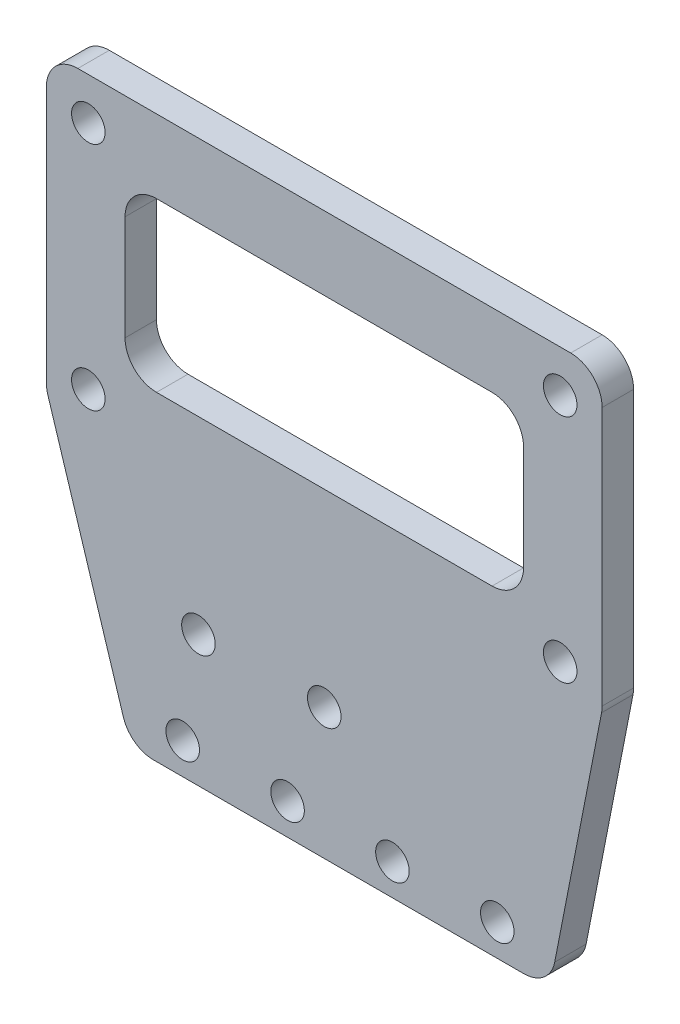
ISO-10303-21;
HEADER;
FILE_DESCRIPTION(('STEP AP214'),'2;1');
FILE_NAME('part.step','',(''),(''),'','','');
FILE_SCHEMA(('AUTOMOTIVE_DESIGN { 1 0 10303 214 1 1 1 1 }'));
ENDSEC;
DATA;
#1=APPLICATION_CONTEXT('core data for automotive mechanical design processes');
#2=APPLICATION_PROTOCOL_DEFINITION('international standard','automotive_design',2000,#1);
#3=PRODUCT_CONTEXT('',#1,'mechanical');
#4=PRODUCT('Part','Part','',(#3));
#5=PRODUCT_RELATED_PRODUCT_CATEGORY('part','',(#4));
#6=PRODUCT_DEFINITION_FORMATION('','',#4);
#7=PRODUCT_DEFINITION_CONTEXT('part definition',#1,'design');
#8=PRODUCT_DEFINITION('design','',#6,#7);
#9=PRODUCT_DEFINITION_SHAPE('','',#8);
#10=(LENGTH_UNIT() NAMED_UNIT(*) SI_UNIT(.MILLI.,.METRE.));
#11=(NAMED_UNIT(*) PLANE_ANGLE_UNIT() SI_UNIT($,.RADIAN.));
#12=(NAMED_UNIT(*) SI_UNIT($,.STERADIAN.) SOLID_ANGLE_UNIT());
#13=UNCERTAINTY_MEASURE_WITH_UNIT(LENGTH_MEASURE(1.E-05),#10,'distance_accuracy_value','');
#14=(GEOMETRIC_REPRESENTATION_CONTEXT(3) GLOBAL_UNCERTAINTY_ASSIGNED_CONTEXT((#13)) GLOBAL_UNIT_ASSIGNED_CONTEXT((#10,
#11,#12)) REPRESENTATION_CONTEXT('',''));
#15=CARTESIAN_POINT('',(0.,0.,0.));
#16=DIRECTION('',(0.,0.,1.));
#17=DIRECTION('',(1.,0.,0.));
#18=AXIS2_PLACEMENT_3D('',#15,#16,#17);
#19=CARTESIAN_POINT('',(0.,0.,3.));
#20=DIRECTION('',(0.,0.,-1.));
#21=DIRECTION('',(-1.,0.,0.));
#22=AXIS2_PLACEMENT_3D('',#19,#20,#21);
#23=PLANE('',#22);
#24=DIRECTION('',(0.,-1.,0.));
#25=VECTOR('',#24,1.);
#26=CARTESIAN_POINT('',(-2.5,46.5,3.));
#27=LINE('',#26,#25);
#28=CARTESIAN_POINT('',(-2.5,43.5,3.));
#29=VERTEX_POINT('',#28);
#30=CARTESIAN_POINT('',(-2.5,33.5,3.));
#31=VERTEX_POINT('',#30);
#32=EDGE_CURVE('E315',#29,#31,#27,.T.);
#33=ORIENTED_EDGE('',*,*,#32,.T.);
#34=CARTESIAN_POINT('',(-5.5,33.5,3.));
#35=DIRECTION('',(0.,0.,-1.));
#36=DIRECTION('',(-1.,0.,0.));
#37=AXIS2_PLACEMENT_3D('',#34,#35,#36);
#38=CIRCLE('',#37,3.);
#39=CARTESIAN_POINT('',(-5.5,30.5,3.));
#40=VERTEX_POINT('',#39);
#41=EDGE_CURVE('E11',#31,#40,#38,.T.);
#42=ORIENTED_EDGE('',*,*,#41,.T.);
#43=DIRECTION('',(-1.,0.,0.));
#44=VECTOR('',#43,1.);
#45=CARTESIAN_POINT('',(-2.5,30.5,3.));
#46=LINE('',#45,#44);
#47=CARTESIAN_POINT('',(-37.5,30.5,3.));
#48=VERTEX_POINT('',#47);
#49=EDGE_CURVE('E313',#40,#48,#46,.T.);
#50=ORIENTED_EDGE('',*,*,#49,.T.);
#51=CARTESIAN_POINT('',(-37.5,33.5,3.));
#52=DIRECTION('',(0.,0.,-1.));
#53=DIRECTION('',(-1.,0.,0.));
#54=AXIS2_PLACEMENT_3D('',#51,#52,#53);
#55=CIRCLE('',#54,3.);
#56=CARTESIAN_POINT('',(-40.5,33.5,3.));
#57=VERTEX_POINT('',#56);
#58=EDGE_CURVE('E287',#48,#57,#55,.T.);
#59=ORIENTED_EDGE('',*,*,#58,.T.);
#60=DIRECTION('',(0.,1.,0.));
#61=VECTOR('',#60,1.);
#62=CARTESIAN_POINT('',(-40.5,46.5,3.));
#63=LINE('',#62,#61);
#64=CARTESIAN_POINT('',(-40.5,43.5,3.));
#65=VERTEX_POINT('',#64);
#66=EDGE_CURVE('E334',#57,#65,#63,.T.);
#67=ORIENTED_EDGE('',*,*,#66,.T.);
#68=CARTESIAN_POINT('',(-37.5,43.5,3.));
#69=DIRECTION('',(0.,0.,-1.));
#70=DIRECTION('',(-1.,0.,0.));
#71=AXIS2_PLACEMENT_3D('',#68,#69,#70);
#72=CIRCLE('',#71,3.);
#73=CARTESIAN_POINT('',(-37.5,46.5,3.));
#74=VERTEX_POINT('',#73);
#75=EDGE_CURVE('E291',#65,#74,#72,.T.);
#76=ORIENTED_EDGE('',*,*,#75,.T.);
#77=DIRECTION('',(1.,0.,0.));
#78=VECTOR('',#77,1.);
#79=CARTESIAN_POINT('',(-2.5,46.5,3.));
#80=LINE('',#79,#78);
#81=CARTESIAN_POINT('',(-5.5,46.5,3.));
#82=VERTEX_POINT('',#81);
#83=EDGE_CURVE('E324',#74,#82,#80,.T.);
#84=ORIENTED_EDGE('',*,*,#83,.T.);
#85=CARTESIAN_POINT('',(-5.5,43.5,3.));
#86=DIRECTION('',(0.,0.,-1.));
#87=DIRECTION('',(-1.,0.,0.));
#88=AXIS2_PLACEMENT_3D('',#85,#86,#87);
#89=CIRCLE('',#88,3.);
#90=EDGE_CURVE('E56',#82,#29,#89,.T.);
#91=ORIENTED_EDGE('',*,*,#90,.T.);
#92=EDGE_LOOP('',(#33,#42,#50,#59,#67,#76,#84,#91));
#93=FACE_BOUND('',#92,.T.);
#94=CARTESIAN_POINT('',(-33.5,12.5,3.));
#95=DIRECTION('',(0.,0.,1.));
#96=DIRECTION('',(1.,0.,0.));
#97=AXIS2_PLACEMENT_3D('',#94,#95,#96);
#98=CIRCLE('',#97,1.60000000000001);
#99=CARTESIAN_POINT('',(-31.9,12.5,3.));
#100=VERTEX_POINT('',#99);
#101=EDGE_CURVE('E339',#100,#100,#98,.T.);
#102=ORIENTED_EDGE('',*,*,#101,.F.);
#103=EDGE_LOOP('',(#102));
#104=FACE_BOUND('',#103,.T.);
#105=CARTESIAN_POINT('',(-21.5,12.5,3.));
#106=DIRECTION('',(0.,0.,1.));
#107=DIRECTION('',(1.,0.,0.));
#108=AXIS2_PLACEMENT_3D('',#105,#106,#107);
#109=CIRCLE('',#108,1.60000000000001);
#110=CARTESIAN_POINT('',(-19.9,12.5,3.));
#111=VERTEX_POINT('',#110);
#112=EDGE_CURVE('E319',#111,#111,#109,.T.);
#113=ORIENTED_EDGE('',*,*,#112,.F.);
#114=EDGE_LOOP('',(#113));
#115=FACE_BOUND('',#114,.T.);
#116=CARTESIAN_POINT('',(-5.,3.,3.));
#117=DIRECTION('',(0.,0.,1.));
#118=DIRECTION('',(1.,0.,0.));
#119=AXIS2_PLACEMENT_3D('',#116,#117,#118);
#120=CIRCLE('',#119,1.6);
#121=CARTESIAN_POINT('',(-3.4,3.,3.));
#122=VERTEX_POINT('',#121);
#123=EDGE_CURVE('E348',#122,#122,#120,.T.);
#124=ORIENTED_EDGE('',*,*,#123,.F.);
#125=EDGE_LOOP('',(#124));
#126=FACE_BOUND('',#125,.T.);
#127=CARTESIAN_POINT('',(-15.,2.99999999999993,3.));
#128=DIRECTION('',(0.,0.,1.));
#129=DIRECTION('',(1.,0.,0.));
#130=AXIS2_PLACEMENT_3D('',#127,#128,#129);
#131=CIRCLE('',#130,1.6);
#132=CARTESIAN_POINT('',(-13.4,2.99999999999993,3.));
#133=VERTEX_POINT('',#132);
#134=EDGE_CURVE('E354',#133,#133,#131,.T.);
#135=ORIENTED_EDGE('',*,*,#134,.F.);
#136=EDGE_LOOP('',(#135));
#137=FACE_BOUND('',#136,.T.);
#138=CARTESIAN_POINT('',(-25.,2.99999999999986,3.));
#139=DIRECTION('',(0.,0.,1.));
#140=DIRECTION('',(1.,0.,0.));
#141=AXIS2_PLACEMENT_3D('',#138,#139,#140);
#142=CIRCLE('',#141,1.6);
#143=CARTESIAN_POINT('',(-23.4,2.99999999999986,3.));
#144=VERTEX_POINT('',#143);
#145=EDGE_CURVE('E360',#144,#144,#142,.T.);
#146=ORIENTED_EDGE('',*,*,#145,.F.);
#147=EDGE_LOOP('',(#146));
#148=FACE_BOUND('',#147,.T.);
#149=CARTESIAN_POINT('',(-35.,2.99999999999979,3.));
#150=DIRECTION('',(0.,0.,1.));
#151=DIRECTION('',(1.,0.,0.));
#152=AXIS2_PLACEMENT_3D('',#149,#150,#151);
#153=CIRCLE('',#152,1.6);
#154=CARTESIAN_POINT('',(-33.4,2.99999999999979,3.));
#155=VERTEX_POINT('',#154);
#156=EDGE_CURVE('E338',#155,#155,#153,.T.);
#157=ORIENTED_EDGE('',*,*,#156,.F.);
#158=EDGE_LOOP('',(#157));
#159=FACE_BOUND('',#158,.T.);
#160=DIRECTION('',(1.,0.,0.));
#161=VECTOR('',#160,1.);
#162=CARTESIAN_POINT('',(0.,0.,3.));
#163=LINE('',#162,#161);
#164=CARTESIAN_POINT('',(-37.7958574255979,0.,3.));
#165=VERTEX_POINT('',#164);
#166=CARTESIAN_POINT('',(-2.46971763062084,0.,3.));
#167=VERTEX_POINT('',#166);
#168=EDGE_CURVE('E209',#165,#167,#163,.T.);
#169=ORIENTED_EDGE('',*,*,#168,.T.);
#170=CARTESIAN_POINT('',(-2.46971763062085,3.,3.));
#171=DIRECTION('',(0.,0.,-1.));
#172=DIRECTION('',(-1.,0.,0.));
#173=AXIS2_PLACEMENT_3D('',#170,#171,#172);
#174=CIRCLE('',#173,3.);
#175=CARTESIAN_POINT('',(0.474413109820908,2.42372386550726,3.));
#176=VERTEX_POINT('',#175);
#177=EDGE_CURVE('E244',#167,#176,#174,.F.);
#178=ORIENTED_EDGE('',*,*,#177,.T.);
#179=DIRECTION('',(0.192092044830911,0.981376913480585,0.));
#180=VECTOR('',#179,1.);
#181=CARTESIAN_POINT('',(5.,25.5444444444444,3.));
#182=LINE('',#181,#180);
#183=CARTESIAN_POINT('',(4.94413074044176,25.2590146050569,3.));
#184=VERTEX_POINT('',#183);
#185=EDGE_CURVE('E192',#176,#184,#182,.T.);
#186=ORIENTED_EDGE('',*,*,#185,.T.);
#187=CARTESIAN_POINT('',(2.,25.8352907395496,3.));
#188=DIRECTION('',(0.,0.,-1.));
#189=DIRECTION('',(-1.,0.,0.));
#190=AXIS2_PLACEMENT_3D('',#187,#188,#189);
#191=CIRCLE('',#190,3.);
#192=CARTESIAN_POINT('',(5.,25.8352907395496,3.));
#193=VERTEX_POINT('',#192);
#194=EDGE_CURVE('E242',#184,#193,#191,.F.);
#195=ORIENTED_EDGE('',*,*,#194,.T.);
#196=DIRECTION('',(0.,1.,0.));
#197=VECTOR('',#196,1.);
#198=CARTESIAN_POINT('',(5.,53.5,3.));
#199=LINE('',#198,#197);
#200=CARTESIAN_POINT('',(5.,50.5,3.));
#201=VERTEX_POINT('',#200);
#202=EDGE_CURVE('E388',#193,#201,#199,.T.);
#203=ORIENTED_EDGE('',*,*,#202,.T.);
#204=CARTESIAN_POINT('',(1.99999999999999,50.5,3.));
#205=DIRECTION('',(0.,0.,-1.));
#206=DIRECTION('',(-1.,0.,0.));
#207=AXIS2_PLACEMENT_3D('',#204,#205,#206);
#208=CIRCLE('',#207,3.);
#209=CARTESIAN_POINT('',(1.99999999999999,53.5,3.));
#210=VERTEX_POINT('',#209);
#211=EDGE_CURVE('E240',#201,#210,#208,.F.);
#212=ORIENTED_EDGE('',*,*,#211,.T.);
#213=DIRECTION('',(-1.,0.,0.));
#214=VECTOR('',#213,1.);
#215=CARTESIAN_POINT('',(-48.,53.5,3.));
#216=LINE('',#215,#214);
#217=CARTESIAN_POINT('',(-45.,53.5,3.));
#218=VERTEX_POINT('',#217);
#219=EDGE_CURVE('E391',#210,#218,#216,.T.);
#220=ORIENTED_EDGE('',*,*,#219,.T.);
#221=CARTESIAN_POINT('',(-45.,50.5,3.));
#222=DIRECTION('',(0.,0.,-1.));
#223=DIRECTION('',(-1.,0.,0.));
#224=AXIS2_PLACEMENT_3D('',#221,#222,#223);
#225=CIRCLE('',#224,3.);
#226=CARTESIAN_POINT('',(-48.,50.5,3.));
#227=VERTEX_POINT('',#226);
#228=EDGE_CURVE('E238',#218,#227,#225,.F.);
#229=ORIENTED_EDGE('',*,*,#228,.T.);
#230=DIRECTION('',(0.,-1.,0.));
#231=VECTOR('',#230,1.);
#232=CARTESIAN_POINT('',(-48.,25.5444444444444,3.));
#233=LINE('',#232,#231);
#234=CARTESIAN_POINT('',(-48.,26.0032274702089,3.));
#235=VERTEX_POINT('',#234);
#236=EDGE_CURVE('E394',#227,#235,#233,.T.);
#237=ORIENTED_EDGE('',*,*,#236,.T.);
#238=CARTESIAN_POINT('',(-45.,26.0032274702089,3.));
#239=DIRECTION('',(0.,0.,-1.));
#240=DIRECTION('',(-1.,0.,0.));
#241=AXIS2_PLACEMENT_3D('',#238,#239,#240);
#242=CIRCLE('',#241,3.);
#243=CARTESIAN_POINT('',(-47.8628854378169,25.1066300299182,3.));
#244=VERTEX_POINT('',#243);
#245=EDGE_CURVE('E236',#235,#244,#242,.F.);
#246=ORIENTED_EDGE('',*,*,#245,.T.);
#247=DIRECTION('',(0.298865813430215,-0.954295145938978,0.));
#248=VECTOR('',#247,1.);
#249=CARTESIAN_POINT('',(-40.,0.,3.));
#250=LINE('',#249,#248);
#251=CARTESIAN_POINT('',(-40.6587428634149,2.10340255970935,3.));
#252=VERTEX_POINT('',#251);
#253=EDGE_CURVE('E396',#244,#252,#250,.T.);
#254=ORIENTED_EDGE('',*,*,#253,.T.);
#255=CARTESIAN_POINT('',(-37.7958574255979,3.,3.));
#256=DIRECTION('',(0.,0.,-1.));
#257=DIRECTION('',(-1.,0.,0.));
#258=AXIS2_PLACEMENT_3D('',#255,#256,#257);
#259=CIRCLE('',#258,3.);
#260=EDGE_CURVE('E234',#252,#165,#259,.F.);
#261=ORIENTED_EDGE('',*,*,#260,.T.);
#262=EDGE_LOOP('',(#169,#178,#186,#195,#203,#212,#220,#229,#237,#246,#254,#261));
#263=FACE_BOUND('',#262,.T.);
#264=CARTESIAN_POINT('',(1.,49.5,3.));
#265=DIRECTION('',(0.,0.,1.));
#266=DIRECTION('',(1.,0.,0.));
#267=AXIS2_PLACEMENT_3D('',#264,#265,#266);
#268=CIRCLE('',#267,1.59999999999999);
#269=CARTESIAN_POINT('',(2.59999999999999,49.5,3.));
#270=VERTEX_POINT('',#269);
#271=EDGE_CURVE('E200',#270,#270,#268,.T.);
#272=ORIENTED_EDGE('',*,*,#271,.F.);
#273=EDGE_LOOP('',(#272));
#274=FACE_BOUND('',#273,.T.);
#275=CARTESIAN_POINT('',(-44.,49.5,3.));
#276=DIRECTION('',(0.,0.,1.));
#277=DIRECTION('',(1.,0.,0.));
#278=AXIS2_PLACEMENT_3D('',#275,#276,#277);
#279=CIRCLE('',#278,1.6);
#280=CARTESIAN_POINT('',(-42.4,49.5,3.));
#281=VERTEX_POINT('',#280);
#282=EDGE_CURVE('E380',#281,#281,#279,.T.);
#283=ORIENTED_EDGE('',*,*,#282,.F.);
#284=EDGE_LOOP('',(#283));
#285=FACE_BOUND('',#284,.T.);
#286=CARTESIAN_POINT('',(1.,27.5,3.));
#287=DIRECTION('',(0.,0.,1.));
#288=DIRECTION('',(1.,0.,0.));
#289=AXIS2_PLACEMENT_3D('',#286,#287,#288);
#290=CIRCLE('',#289,1.6);
#291=CARTESIAN_POINT('',(2.6,27.5,3.));
#292=VERTEX_POINT('',#291);
#293=EDGE_CURVE('E374',#292,#292,#290,.T.);
#294=ORIENTED_EDGE('',*,*,#293,.F.);
#295=EDGE_LOOP('',(#294));
#296=FACE_BOUND('',#295,.T.);
#297=CARTESIAN_POINT('',(-44.,27.5,3.));
#298=DIRECTION('',(0.,0.,1.));
#299=DIRECTION('',(1.,0.,0.));
#300=AXIS2_PLACEMENT_3D('',#297,#298,#299);
#301=CIRCLE('',#300,1.6);
#302=CARTESIAN_POINT('',(-42.4,27.5,3.));
#303=VERTEX_POINT('',#302);
#304=EDGE_CURVE('E368',#303,#303,#301,.T.);
#305=ORIENTED_EDGE('',*,*,#304,.F.);
#306=EDGE_LOOP('',(#305));
#307=FACE_BOUND('',#306,.T.);
#308=ADVANCED_FACE('F34',(#93,#104,#115,#126,#137,#148,#159,#263,#274,#285,#296,#307),#23,.F.);
#309=CARTESIAN_POINT('',(0.,0.,0.));
#310=DIRECTION('',(0.,0.,-1.));
#311=DIRECTION('',(-1.,0.,0.));
#312=AXIS2_PLACEMENT_3D('',#309,#310,#311);
#313=PLANE('',#312);
#314=DIRECTION('',(0.,1.,0.));
#315=VECTOR('',#314,1.);
#316=CARTESIAN_POINT('',(-40.5,46.5,0.));
#317=LINE('',#316,#315);
#318=CARTESIAN_POINT('',(-40.5,33.5,0.));
#319=VERTEX_POINT('',#318);
#320=CARTESIAN_POINT('',(-40.5,43.5,0.));
#321=VERTEX_POINT('',#320);
#322=EDGE_CURVE('E328',#319,#321,#317,.T.);
#323=ORIENTED_EDGE('',*,*,#322,.F.);
#324=CARTESIAN_POINT('',(-37.5,33.5,0.));
#325=DIRECTION('',(0.,0.,-1.));
#326=DIRECTION('',(-1.,0.,0.));
#327=AXIS2_PLACEMENT_3D('',#324,#325,#326);
#328=CIRCLE('',#327,3.);
#329=CARTESIAN_POINT('',(-37.5,30.5,0.));
#330=VERTEX_POINT('',#329);
#331=EDGE_CURVE('E285',#319,#330,#328,.F.);
#332=ORIENTED_EDGE('',*,*,#331,.T.);
#333=DIRECTION('',(-1.,0.,0.));
#334=VECTOR('',#333,1.);
#335=CARTESIAN_POINT('',(-2.5,30.5,0.));
#336=LINE('',#335,#334);
#337=CARTESIAN_POINT('',(-5.5,30.5,0.));
#338=VERTEX_POINT('',#337);
#339=EDGE_CURVE('E302',#338,#330,#336,.T.);
#340=ORIENTED_EDGE('',*,*,#339,.F.);
#341=CARTESIAN_POINT('',(-5.5,33.5,0.));
#342=DIRECTION('',(0.,0.,-1.));
#343=DIRECTION('',(-1.,0.,0.));
#344=AXIS2_PLACEMENT_3D('',#341,#342,#343);
#345=CIRCLE('',#344,3.);
#346=CARTESIAN_POINT('',(-2.5,33.5,0.));
#347=VERTEX_POINT('',#346);
#348=EDGE_CURVE('E42',#338,#347,#345,.F.);
#349=ORIENTED_EDGE('',*,*,#348,.T.);
#350=DIRECTION('',(0.,-1.,0.));
#351=VECTOR('',#350,1.);
#352=CARTESIAN_POINT('',(-2.5,46.5,0.));
#353=LINE('',#352,#351);
#354=CARTESIAN_POINT('',(-2.5,43.5,0.));
#355=VERTEX_POINT('',#354);
#356=EDGE_CURVE('E300',#355,#347,#353,.T.);
#357=ORIENTED_EDGE('',*,*,#356,.F.);
#358=CARTESIAN_POINT('',(-5.5,43.5,0.));
#359=DIRECTION('',(0.,0.,-1.));
#360=DIRECTION('',(-1.,0.,0.));
#361=AXIS2_PLACEMENT_3D('',#358,#359,#360);
#362=CIRCLE('',#361,3.);
#363=CARTESIAN_POINT('',(-5.5,46.5,0.));
#364=VERTEX_POINT('',#363);
#365=EDGE_CURVE('E293',#355,#364,#362,.F.);
#366=ORIENTED_EDGE('',*,*,#365,.T.);
#367=DIRECTION('',(1.,0.,0.));
#368=VECTOR('',#367,1.);
#369=CARTESIAN_POINT('',(-2.5,46.5,0.));
#370=LINE('',#369,#368);
#371=CARTESIAN_POINT('',(-37.5,46.5,0.));
#372=VERTEX_POINT('',#371);
#373=EDGE_CURVE('E307',#372,#364,#370,.T.);
#374=ORIENTED_EDGE('',*,*,#373,.F.);
#375=CARTESIAN_POINT('',(-37.5,43.5,0.));
#376=DIRECTION('',(0.,0.,-1.));
#377=DIRECTION('',(-1.,0.,0.));
#378=AXIS2_PLACEMENT_3D('',#375,#376,#377);
#379=CIRCLE('',#378,3.);
#380=EDGE_CURVE('E289',#372,#321,#379,.F.);
#381=ORIENTED_EDGE('',*,*,#380,.T.);
#382=EDGE_LOOP('',(#323,#332,#340,#349,#357,#366,#374,#381));
#383=FACE_BOUND('',#382,.T.);
#384=CARTESIAN_POINT('',(-33.5,12.5,0.));
#385=DIRECTION('',(0.,0.,1.));
#386=DIRECTION('',(1.,0.,0.));
#387=AXIS2_PLACEMENT_3D('',#384,#385,#386);
#388=CIRCLE('',#387,1.60000000000001);
#389=CARTESIAN_POINT('',(-31.9,12.5,0.));
#390=VERTEX_POINT('',#389);
#391=EDGE_CURVE('E335',#390,#390,#388,.T.);
#392=ORIENTED_EDGE('',*,*,#391,.T.);
#393=EDGE_LOOP('',(#392));
#394=FACE_BOUND('',#393,.T.);
#395=CARTESIAN_POINT('',(-21.5,12.5,0.));
#396=DIRECTION('',(0.,0.,1.));
#397=DIRECTION('',(1.,0.,0.));
#398=AXIS2_PLACEMENT_3D('',#395,#396,#397);
#399=CIRCLE('',#398,1.60000000000001);
#400=CARTESIAN_POINT('',(-19.9,12.5,0.));
#401=VERTEX_POINT('',#400);
#402=EDGE_CURVE('E322',#401,#401,#399,.T.);
#403=ORIENTED_EDGE('',*,*,#402,.T.);
#404=EDGE_LOOP('',(#403));
#405=FACE_BOUND('',#404,.T.);
#406=CARTESIAN_POINT('',(-5.,3.,0.));
#407=DIRECTION('',(0.,0.,1.));
#408=DIRECTION('',(1.,0.,0.));
#409=AXIS2_PLACEMENT_3D('',#406,#407,#408);
#410=CIRCLE('',#409,1.6);
#411=CARTESIAN_POINT('',(-3.4,3.,0.));
#412=VERTEX_POINT('',#411);
#413=EDGE_CURVE('E344',#412,#412,#410,.T.);
#414=ORIENTED_EDGE('',*,*,#413,.T.);
#415=EDGE_LOOP('',(#414));
#416=FACE_BOUND('',#415,.T.);
#417=CARTESIAN_POINT('',(-15.,2.99999999999993,0.));
#418=DIRECTION('',(0.,0.,1.));
#419=DIRECTION('',(1.,0.,0.));
#420=AXIS2_PLACEMENT_3D('',#417,#418,#419);
#421=CIRCLE('',#420,1.6);
#422=CARTESIAN_POINT('',(-13.4,2.99999999999993,0.));
#423=VERTEX_POINT('',#422);
#424=EDGE_CURVE('E351',#423,#423,#421,.T.);
#425=ORIENTED_EDGE('',*,*,#424,.T.);
#426=EDGE_LOOP('',(#425));
#427=FACE_BOUND('',#426,.T.);
#428=CARTESIAN_POINT('',(-25.,2.99999999999986,0.));
#429=DIRECTION('',(0.,0.,1.));
#430=DIRECTION('',(1.,0.,0.));
#431=AXIS2_PLACEMENT_3D('',#428,#429,#430);
#432=CIRCLE('',#431,1.6);
#433=CARTESIAN_POINT('',(-23.4,2.99999999999986,0.));
#434=VERTEX_POINT('',#433);
#435=EDGE_CURVE('E357',#434,#434,#432,.T.);
#436=ORIENTED_EDGE('',*,*,#435,.T.);
#437=EDGE_LOOP('',(#436));
#438=FACE_BOUND('',#437,.T.);
#439=CARTESIAN_POINT('',(-35.,2.99999999999979,0.));
#440=DIRECTION('',(0.,0.,1.));
#441=DIRECTION('',(1.,0.,0.));
#442=AXIS2_PLACEMENT_3D('',#439,#440,#441);
#443=CIRCLE('',#442,1.6);
#444=CARTESIAN_POINT('',(-33.4,2.99999999999979,0.));
#445=VERTEX_POINT('',#444);
#446=EDGE_CURVE('E363',#445,#445,#443,.T.);
#447=ORIENTED_EDGE('',*,*,#446,.T.);
#448=EDGE_LOOP('',(#447));
#449=FACE_BOUND('',#448,.T.);
#450=CARTESIAN_POINT('',(1.,27.5,0.));
#451=DIRECTION('',(0.,0.,1.));
#452=DIRECTION('',(1.,0.,0.));
#453=AXIS2_PLACEMENT_3D('',#450,#451,#452);
#454=CIRCLE('',#453,1.6);
#455=CARTESIAN_POINT('',(2.6,27.5,0.));
#456=VERTEX_POINT('',#455);
#457=EDGE_CURVE('E371',#456,#456,#454,.T.);
#458=ORIENTED_EDGE('',*,*,#457,.T.);
#459=EDGE_LOOP('',(#458));
#460=FACE_BOUND('',#459,.T.);
#461=CARTESIAN_POINT('',(1.,49.5,0.));
#462=DIRECTION('',(0.,0.,1.));
#463=DIRECTION('',(1.,0.,0.));
#464=AXIS2_PLACEMENT_3D('',#461,#462,#463);
#465=CIRCLE('',#464,1.59999999999999);
#466=CARTESIAN_POINT('',(2.59999999999999,49.5,0.));
#467=VERTEX_POINT('',#466);
#468=EDGE_CURVE('E206',#467,#467,#465,.T.);
#469=ORIENTED_EDGE('',*,*,#468,.T.);
#470=EDGE_LOOP('',(#469));
#471=FACE_BOUND('',#470,.T.);
#472=DIRECTION('',(0.192092044830911,0.981376913480585,0.));
#473=VECTOR('',#472,1.);
#474=CARTESIAN_POINT('',(5.,25.5444444444444,0.));
#475=LINE('',#474,#473);
#476=CARTESIAN_POINT('',(0.474413109820908,2.42372386550726,0.));
#477=VERTEX_POINT('',#476);
#478=CARTESIAN_POINT('',(4.94413074044176,25.2590146050569,0.));
#479=VERTEX_POINT('',#478);
#480=EDGE_CURVE('E189',#477,#479,#475,.T.);
#481=ORIENTED_EDGE('',*,*,#480,.F.);
#482=CARTESIAN_POINT('',(-2.46971763062085,3.,0.));
#483=DIRECTION('',(0.,0.,-1.));
#484=DIRECTION('',(-1.,0.,0.));
#485=AXIS2_PLACEMENT_3D('',#482,#483,#484);
#486=CIRCLE('',#485,3.);
#487=CARTESIAN_POINT('',(-2.46971763062084,0.,0.));
#488=VERTEX_POINT('',#487);
#489=EDGE_CURVE('E172',#477,#488,#486,.T.);
#490=ORIENTED_EDGE('',*,*,#489,.T.);
#491=DIRECTION('',(1.,0.,0.));
#492=VECTOR('',#491,1.);
#493=CARTESIAN_POINT('',(0.,0.,0.));
#494=LINE('',#493,#492);
#495=CARTESIAN_POINT('',(-37.7958574255979,0.,0.));
#496=VERTEX_POINT('',#495);
#497=EDGE_CURVE('E220',#496,#488,#494,.T.);
#498=ORIENTED_EDGE('',*,*,#497,.F.);
#499=CARTESIAN_POINT('',(-37.7958574255979,3.,0.));
#500=DIRECTION('',(0.,0.,-1.));
#501=DIRECTION('',(-1.,0.,0.));
#502=AXIS2_PLACEMENT_3D('',#499,#500,#501);
#503=CIRCLE('',#502,3.);
#504=CARTESIAN_POINT('',(-40.6587428634149,2.10340255970935,0.));
#505=VERTEX_POINT('',#504);
#506=EDGE_CURVE('E193',#496,#505,#503,.T.);
#507=ORIENTED_EDGE('',*,*,#506,.T.);
#508=DIRECTION('',(0.298865813430215,-0.954295145938978,0.));
#509=VECTOR('',#508,1.);
#510=CARTESIAN_POINT('',(-40.,0.,0.));
#511=LINE('',#510,#509);
#512=CARTESIAN_POINT('',(-47.8628854378169,25.1066300299182,0.));
#513=VERTEX_POINT('',#512);
#514=EDGE_CURVE('E217',#513,#505,#511,.T.);
#515=ORIENTED_EDGE('',*,*,#514,.F.);
#516=CARTESIAN_POINT('',(-45.,26.0032274702089,0.));
#517=DIRECTION('',(0.,0.,-1.));
#518=DIRECTION('',(-1.,0.,0.));
#519=AXIS2_PLACEMENT_3D('',#516,#517,#518);
#520=CIRCLE('',#519,3.);
#521=CARTESIAN_POINT('',(-48.,26.0032274702089,0.));
#522=VERTEX_POINT('',#521);
#523=EDGE_CURVE('E224',#513,#522,#520,.T.);
#524=ORIENTED_EDGE('',*,*,#523,.T.);
#525=DIRECTION('',(0.,-1.,0.));
#526=VECTOR('',#525,1.);
#527=CARTESIAN_POINT('',(-48.,25.5444444444444,0.));
#528=LINE('',#527,#526);
#529=CARTESIAN_POINT('',(-48.,50.5,0.));
#530=VERTEX_POINT('',#529);
#531=EDGE_CURVE('E214',#530,#522,#528,.T.);
#532=ORIENTED_EDGE('',*,*,#531,.F.);
#533=CARTESIAN_POINT('',(-45.,50.5,0.));
#534=DIRECTION('',(0.,0.,-1.));
#535=DIRECTION('',(-1.,0.,0.));
#536=AXIS2_PLACEMENT_3D('',#533,#534,#535);
#537=CIRCLE('',#536,3.);
#538=CARTESIAN_POINT('',(-45.,53.5,0.));
#539=VERTEX_POINT('',#538);
#540=EDGE_CURVE('E226',#530,#539,#537,.T.);
#541=ORIENTED_EDGE('',*,*,#540,.T.);
#542=DIRECTION('',(-1.,0.,0.));
#543=VECTOR('',#542,1.);
#544=CARTESIAN_POINT('',(-48.,53.5,0.));
#545=LINE('',#544,#543);
#546=CARTESIAN_POINT('',(1.99999999999999,53.5,0.));
#547=VERTEX_POINT('',#546);
#548=EDGE_CURVE('E203',#547,#539,#545,.T.);
#549=ORIENTED_EDGE('',*,*,#548,.F.);
#550=CARTESIAN_POINT('',(1.99999999999999,50.5,0.));
#551=DIRECTION('',(0.,0.,-1.));
#552=DIRECTION('',(-1.,0.,0.));
#553=AXIS2_PLACEMENT_3D('',#550,#551,#552);
#554=CIRCLE('',#553,3.);
#555=CARTESIAN_POINT('',(5.,50.5,0.));
#556=VERTEX_POINT('',#555);
#557=EDGE_CURVE('E228',#547,#556,#554,.T.);
#558=ORIENTED_EDGE('',*,*,#557,.T.);
#559=DIRECTION('',(0.,1.,0.));
#560=VECTOR('',#559,1.);
#561=CARTESIAN_POINT('',(5.,53.5,0.));
#562=LINE('',#561,#560);
#563=CARTESIAN_POINT('',(5.,25.8352907395496,0.));
#564=VERTEX_POINT('',#563);
#565=EDGE_CURVE('E199',#564,#556,#562,.T.);
#566=ORIENTED_EDGE('',*,*,#565,.F.);
#567=CARTESIAN_POINT('',(2.,25.8352907395496,0.));
#568=DIRECTION('',(0.,0.,-1.));
#569=DIRECTION('',(-1.,0.,0.));
#570=AXIS2_PLACEMENT_3D('',#567,#568,#569);
#571=CIRCLE('',#570,3.);
#572=EDGE_CURVE('E183',#564,#479,#571,.T.);
#573=ORIENTED_EDGE('',*,*,#572,.T.);
#574=EDGE_LOOP('',(#481,#490,#498,#507,#515,#524,#532,#541,#549,#558,#566,#573));
#575=FACE_BOUND('',#574,.T.);
#576=CARTESIAN_POINT('',(-44.,49.5,0.));
#577=DIRECTION('',(0.,0.,1.));
#578=DIRECTION('',(1.,0.,0.));
#579=AXIS2_PLACEMENT_3D('',#576,#577,#578);
#580=CIRCLE('',#579,1.6);
#581=CARTESIAN_POINT('',(-42.4,49.5,0.));
#582=VERTEX_POINT('',#581);
#583=EDGE_CURVE('E377',#582,#582,#580,.T.);
#584=ORIENTED_EDGE('',*,*,#583,.T.);
#585=EDGE_LOOP('',(#584));
#586=FACE_BOUND('',#585,.T.);
#587=CARTESIAN_POINT('',(-44.,27.5,0.));
#588=DIRECTION('',(0.,0.,1.));
#589=DIRECTION('',(1.,0.,0.));
#590=AXIS2_PLACEMENT_3D('',#587,#588,#589);
#591=CIRCLE('',#590,1.6);
#592=CARTESIAN_POINT('',(-42.4,27.5,0.));
#593=VERTEX_POINT('',#592);
#594=EDGE_CURVE('E347',#593,#593,#591,.T.);
#595=ORIENTED_EDGE('',*,*,#594,.T.);
#596=EDGE_LOOP('',(#595));
#597=FACE_BOUND('',#596,.T.);
#598=ADVANCED_FACE('F196',(#383,#394,#405,#416,#427,#438,#449,#460,#471,#575,#586,#597),#313,.T.);
#599=CARTESIAN_POINT('',(5.,25.5444444444444,3.));
#600=DIRECTION('',(-0.981376913480585,0.192092044830911,0.));
#601=DIRECTION('',(-0.192092044830911,-0.981376913480585,0.));
#602=AXIS2_PLACEMENT_3D('',#599,#600,#601);
#603=PLANE('',#602);
#604=ORIENTED_EDGE('',*,*,#185,.F.);
#605=DIRECTION('',(0.,0.,-1.));
#606=VECTOR('',#605,1.);
#607=CARTESIAN_POINT('',(0.474413109820908,2.42372386550727,3.));
#608=LINE('',#607,#606);
#609=EDGE_CURVE('E176',#176,#477,#608,.T.);
#610=ORIENTED_EDGE('',*,*,#609,.T.);
#611=ORIENTED_EDGE('',*,*,#480,.T.);
#612=DIRECTION('',(0.,0.,-1.));
#613=VECTOR('',#612,1.);
#614=CARTESIAN_POINT('',(4.94413074044176,25.2590146050569,3.));
#615=LINE('',#614,#613);
#616=EDGE_CURVE('E194',#479,#184,#615,.F.);
#617=ORIENTED_EDGE('',*,*,#616,.T.);
#618=EDGE_LOOP('',(#604,#610,#611,#617));
#619=FACE_BOUND('',#618,.T.);
#620=ADVANCED_FACE('F188',(#619),#603,.F.);
#621=CARTESIAN_POINT('',(5.,53.5,3.));
#622=DIRECTION('',(-1.,0.,0.));
#623=DIRECTION('',(0.,-1.,0.));
#624=AXIS2_PLACEMENT_3D('',#621,#622,#623);
#625=PLANE('',#624);
#626=ORIENTED_EDGE('',*,*,#202,.F.);
#627=DIRECTION('',(0.,0.,-1.));
#628=VECTOR('',#627,1.);
#629=CARTESIAN_POINT('',(5.,25.8352907395496,3.));
#630=LINE('',#629,#628);
#631=EDGE_CURVE('E248',#193,#564,#630,.T.);
#632=ORIENTED_EDGE('',*,*,#631,.T.);
#633=ORIENTED_EDGE('',*,*,#565,.T.);
#634=DIRECTION('',(0.,0.,-1.));
#635=VECTOR('',#634,1.);
#636=CARTESIAN_POINT('',(5.,50.5,3.));
#637=LINE('',#636,#635);
#638=EDGE_CURVE('E246',#556,#201,#637,.F.);
#639=ORIENTED_EDGE('',*,*,#638,.T.);
#640=EDGE_LOOP('',(#626,#632,#633,#639));
#641=FACE_BOUND('',#640,.T.);
#642=ADVANCED_FACE('F438',(#641),#625,.F.);
#643=CARTESIAN_POINT('',(-48.,53.5,3.));
#644=DIRECTION('',(0.,-1.,0.));
#645=DIRECTION('',(0.,0.,-1.));
#646=AXIS2_PLACEMENT_3D('',#643,#644,#645);
#647=PLANE('',#646);
#648=ORIENTED_EDGE('',*,*,#219,.F.);
#649=DIRECTION('',(0.,0.,-1.));
#650=VECTOR('',#649,1.);
#651=CARTESIAN_POINT('',(1.99999999999999,53.5,3.));
#652=LINE('',#651,#650);
#653=EDGE_CURVE('E253',#210,#547,#652,.T.);
#654=ORIENTED_EDGE('',*,*,#653,.T.);
#655=ORIENTED_EDGE('',*,*,#548,.T.);
#656=DIRECTION('',(0.,0.,-1.));
#657=VECTOR('',#656,1.);
#658=CARTESIAN_POINT('',(-45.,53.5,3.));
#659=LINE('',#658,#657);
#660=EDGE_CURVE('E251',#539,#218,#659,.F.);
#661=ORIENTED_EDGE('',*,*,#660,.T.);
#662=EDGE_LOOP('',(#648,#654,#655,#661));
#663=FACE_BOUND('',#662,.T.);
#664=ADVANCED_FACE('F430',(#663),#647,.F.);
#665=CARTESIAN_POINT('',(-48.,25.5444444444444,3.));
#666=DIRECTION('',(1.,0.,0.));
#667=DIRECTION('',(0.,0.,-1.));
#668=AXIS2_PLACEMENT_3D('',#665,#666,#667);
#669=PLANE('',#668);
#670=ORIENTED_EDGE('',*,*,#236,.F.);
#671=DIRECTION('',(0.,0.,-1.));
#672=VECTOR('',#671,1.);
#673=CARTESIAN_POINT('',(-48.,50.5,3.));
#674=LINE('',#673,#672);
#675=EDGE_CURVE('E258',#227,#530,#674,.T.);
#676=ORIENTED_EDGE('',*,*,#675,.T.);
#677=ORIENTED_EDGE('',*,*,#531,.T.);
#678=DIRECTION('',(0.,0.,-1.));
#679=VECTOR('',#678,1.);
#680=CARTESIAN_POINT('',(-48.,26.0032274702089,3.));
#681=LINE('',#680,#679);
#682=EDGE_CURVE('E256',#522,#235,#681,.F.);
#683=ORIENTED_EDGE('',*,*,#682,.T.);
#684=EDGE_LOOP('',(#670,#676,#677,#683));
#685=FACE_BOUND('',#684,.T.);
#686=ADVANCED_FACE('F421',(#685),#669,.F.);
#687=CARTESIAN_POINT('',(-40.,0.,3.));
#688=DIRECTION('',(0.954295145938978,0.298865813430215,0.));
#689=DIRECTION('',(-0.298865813430215,0.954295145938978,0.));
#690=AXIS2_PLACEMENT_3D('',#687,#688,#689);
#691=PLANE('',#690);
#692=ORIENTED_EDGE('',*,*,#253,.F.);
#693=DIRECTION('',(0.,0.,-1.));
#694=VECTOR('',#693,1.);
#695=CARTESIAN_POINT('',(-47.8628854378169,25.1066300299182,3.));
#696=LINE('',#695,#694);
#697=EDGE_CURVE('E263',#244,#513,#696,.T.);
#698=ORIENTED_EDGE('',*,*,#697,.T.);
#699=ORIENTED_EDGE('',*,*,#514,.T.);
#700=DIRECTION('',(0.,0.,-1.));
#701=VECTOR('',#700,1.);
#702=CARTESIAN_POINT('',(-40.6587428634149,2.10340255970935,3.));
#703=LINE('',#702,#701);
#704=EDGE_CURVE('E261',#505,#252,#703,.F.);
#705=ORIENTED_EDGE('',*,*,#704,.T.);
#706=EDGE_LOOP('',(#692,#698,#699,#705));
#707=FACE_BOUND('',#706,.T.);
#708=ADVANCED_FACE('F412',(#707),#691,.F.);
#709=CARTESIAN_POINT('',(0.,0.,3.));
#710=DIRECTION('',(0.,1.,0.));
#711=DIRECTION('',(-1.,0.,0.));
#712=AXIS2_PLACEMENT_3D('',#709,#710,#711);
#713=PLANE('',#712);
#714=ORIENTED_EDGE('',*,*,#497,.T.);
#715=DIRECTION('',(0.,0.,-1.));
#716=VECTOR('',#715,1.);
#717=CARTESIAN_POINT('',(-2.46971763062084,0.,3.));
#718=LINE('',#717,#716);
#719=EDGE_CURVE('E177',#488,#167,#718,.F.);
#720=ORIENTED_EDGE('',*,*,#719,.T.);
#721=ORIENTED_EDGE('',*,*,#168,.F.);
#722=DIRECTION('',(0.,0.,-1.));
#723=VECTOR('',#722,1.);
#724=CARTESIAN_POINT('',(-37.7958574255979,0.,3.));
#725=LINE('',#724,#723);
#726=EDGE_CURVE('E182',#165,#496,#725,.T.);
#727=ORIENTED_EDGE('',*,*,#726,.T.);
#728=EDGE_LOOP('',(#714,#720,#721,#727));
#729=FACE_BOUND('',#728,.T.);
#730=ADVANCED_FACE('F406',(#729),#713,.F.);
#731=CARTESIAN_POINT('',(1.,49.5,3.));
#732=DIRECTION('',(0.,0.,-1.));
#733=DIRECTION('',(-1.,0.,0.));
#734=AXIS2_PLACEMENT_3D('',#731,#732,#733);
#735=CYLINDRICAL_SURFACE('',#734,1.59999999999999);
#736=ORIENTED_EDGE('',*,*,#271,.T.);
#737=EDGE_LOOP('',(#736));
#738=FACE_BOUND('',#737,.T.);
#739=ORIENTED_EDGE('',*,*,#468,.F.);
#740=EDGE_LOOP('',(#739));
#741=FACE_BOUND('',#740,.T.);
#742=ADVANCED_FACE('F459',(#738,#741),#735,.F.);
#743=CARTESIAN_POINT('',(-44.,49.5,3.));
#744=DIRECTION('',(0.,0.,-1.));
#745=DIRECTION('',(-1.,0.,0.));
#746=AXIS2_PLACEMENT_3D('',#743,#744,#745);
#747=CYLINDRICAL_SURFACE('',#746,1.6);
#748=ORIENTED_EDGE('',*,*,#282,.T.);
#749=EDGE_LOOP('',(#748));
#750=FACE_BOUND('',#749,.T.);
#751=ORIENTED_EDGE('',*,*,#583,.F.);
#752=EDGE_LOOP('',(#751));
#753=FACE_BOUND('',#752,.T.);
#754=ADVANCED_FACE('F505',(#750,#753),#747,.F.);
#755=CARTESIAN_POINT('',(1.,27.5,3.));
#756=DIRECTION('',(0.,0.,-1.));
#757=DIRECTION('',(-1.,0.,0.));
#758=AXIS2_PLACEMENT_3D('',#755,#756,#757);
#759=CYLINDRICAL_SURFACE('',#758,1.6);
#760=ORIENTED_EDGE('',*,*,#293,.T.);
#761=EDGE_LOOP('',(#760));
#762=FACE_BOUND('',#761,.T.);
#763=ORIENTED_EDGE('',*,*,#457,.F.);
#764=EDGE_LOOP('',(#763));
#765=FACE_BOUND('',#764,.T.);
#766=ADVANCED_FACE('F512',(#762,#765),#759,.F.);
#767=CARTESIAN_POINT('',(-44.,27.5,3.));
#768=DIRECTION('',(0.,0.,-1.));
#769=DIRECTION('',(-1.,0.,0.));
#770=AXIS2_PLACEMENT_3D('',#767,#768,#769);
#771=CYLINDRICAL_SURFACE('',#770,1.6);
#772=ORIENTED_EDGE('',*,*,#304,.T.);
#773=EDGE_LOOP('',(#772));
#774=FACE_BOUND('',#773,.T.);
#775=ORIENTED_EDGE('',*,*,#594,.F.);
#776=EDGE_LOOP('',(#775));
#777=FACE_BOUND('',#776,.T.);
#778=ADVANCED_FACE('F519',(#774,#777),#771,.F.);
#779=CARTESIAN_POINT('',(-35.,2.99999999999979,0.));
#780=DIRECTION('',(0.,0.,1.));
#781=DIRECTION('',(1.,0.,0.));
#782=AXIS2_PLACEMENT_3D('',#779,#780,#781);
#783=CYLINDRICAL_SURFACE('',#782,1.6);
#784=ORIENTED_EDGE('',*,*,#446,.F.);
#785=EDGE_LOOP('',(#784));
#786=FACE_BOUND('',#785,.T.);
#787=ORIENTED_EDGE('',*,*,#156,.T.);
#788=EDGE_LOOP('',(#787));
#789=FACE_BOUND('',#788,.T.);
#790=ADVANCED_FACE('F527',(#786,#789),#783,.F.);
#791=CARTESIAN_POINT('',(-25.,2.99999999999986,0.));
#792=DIRECTION('',(0.,0.,1.));
#793=DIRECTION('',(1.,0.,0.));
#794=AXIS2_PLACEMENT_3D('',#791,#792,#793);
#795=CYLINDRICAL_SURFACE('',#794,1.6);
#796=ORIENTED_EDGE('',*,*,#435,.F.);
#797=EDGE_LOOP('',(#796));
#798=FACE_BOUND('',#797,.T.);
#799=ORIENTED_EDGE('',*,*,#145,.T.);
#800=EDGE_LOOP('',(#799));
#801=FACE_BOUND('',#800,.T.);
#802=ADVANCED_FACE('F535',(#798,#801),#795,.F.);
#803=CARTESIAN_POINT('',(-15.,2.99999999999993,0.));
#804=DIRECTION('',(0.,0.,1.));
#805=DIRECTION('',(1.,0.,0.));
#806=AXIS2_PLACEMENT_3D('',#803,#804,#805);
#807=CYLINDRICAL_SURFACE('',#806,1.6);
#808=ORIENTED_EDGE('',*,*,#424,.F.);
#809=EDGE_LOOP('',(#808));
#810=FACE_BOUND('',#809,.T.);
#811=ORIENTED_EDGE('',*,*,#134,.T.);
#812=EDGE_LOOP('',(#811));
#813=FACE_BOUND('',#812,.T.);
#814=ADVANCED_FACE('F543',(#810,#813),#807,.F.);
#815=CARTESIAN_POINT('',(-5.,3.,0.));
#816=DIRECTION('',(0.,0.,1.));
#817=DIRECTION('',(1.,0.,0.));
#818=AXIS2_PLACEMENT_3D('',#815,#816,#817);
#819=CYLINDRICAL_SURFACE('',#818,1.6);
#820=ORIENTED_EDGE('',*,*,#413,.F.);
#821=EDGE_LOOP('',(#820));
#822=FACE_BOUND('',#821,.T.);
#823=ORIENTED_EDGE('',*,*,#123,.T.);
#824=EDGE_LOOP('',(#823));
#825=FACE_BOUND('',#824,.T.);
#826=ADVANCED_FACE('F450',(#822,#825),#819,.F.);
#827=CARTESIAN_POINT('',(-2.46971763062085,3.,3.));
#828=DIRECTION('',(0.,0.,-1.));
#829=DIRECTION('',(-1.,0.,0.));
#830=AXIS2_PLACEMENT_3D('',#827,#828,#829);
#831=CYLINDRICAL_SURFACE('',#830,3.);
#832=ORIENTED_EDGE('',*,*,#177,.F.);
#833=ORIENTED_EDGE('',*,*,#719,.F.);
#834=ORIENTED_EDGE('',*,*,#489,.F.);
#835=ORIENTED_EDGE('',*,*,#609,.F.);
#836=EDGE_LOOP('',(#832,#833,#834,#835));
#837=FACE_BOUND('',#836,.T.);
#838=ADVANCED_FACE('F175',(#837),#831,.T.);
#839=CARTESIAN_POINT('',(2.,25.8352907395496,3.));
#840=DIRECTION('',(0.,0.,-1.));
#841=DIRECTION('',(-1.,0.,0.));
#842=AXIS2_PLACEMENT_3D('',#839,#840,#841);
#843=CYLINDRICAL_SURFACE('',#842,3.);
#844=ORIENTED_EDGE('',*,*,#194,.F.);
#845=ORIENTED_EDGE('',*,*,#616,.F.);
#846=ORIENTED_EDGE('',*,*,#572,.F.);
#847=ORIENTED_EDGE('',*,*,#631,.F.);
#848=EDGE_LOOP('',(#844,#845,#846,#847));
#849=FACE_BOUND('',#848,.T.);
#850=ADVANCED_FACE('F442',(#849),#843,.T.);
#851=CARTESIAN_POINT('',(1.99999999999999,50.5,3.));
#852=DIRECTION('',(0.,0.,-1.));
#853=DIRECTION('',(-1.,0.,0.));
#854=AXIS2_PLACEMENT_3D('',#851,#852,#853);
#855=CYLINDRICAL_SURFACE('',#854,3.);
#856=ORIENTED_EDGE('',*,*,#211,.F.);
#857=ORIENTED_EDGE('',*,*,#638,.F.);
#858=ORIENTED_EDGE('',*,*,#557,.F.);
#859=ORIENTED_EDGE('',*,*,#653,.F.);
#860=EDGE_LOOP('',(#856,#857,#858,#859));
#861=FACE_BOUND('',#860,.T.);
#862=ADVANCED_FACE('F434',(#861),#855,.T.);
#863=CARTESIAN_POINT('',(-45.,50.5,3.));
#864=DIRECTION('',(0.,0.,-1.));
#865=DIRECTION('',(-1.,0.,0.));
#866=AXIS2_PLACEMENT_3D('',#863,#864,#865);
#867=CYLINDRICAL_SURFACE('',#866,3.);
#868=ORIENTED_EDGE('',*,*,#228,.F.);
#869=ORIENTED_EDGE('',*,*,#660,.F.);
#870=ORIENTED_EDGE('',*,*,#540,.F.);
#871=ORIENTED_EDGE('',*,*,#675,.F.);
#872=EDGE_LOOP('',(#868,#869,#870,#871));
#873=FACE_BOUND('',#872,.T.);
#874=ADVANCED_FACE('F425',(#873),#867,.T.);
#875=CARTESIAN_POINT('',(-45.,26.0032274702089,3.));
#876=DIRECTION('',(0.,0.,-1.));
#877=DIRECTION('',(-1.,0.,0.));
#878=AXIS2_PLACEMENT_3D('',#875,#876,#877);
#879=CYLINDRICAL_SURFACE('',#878,3.);
#880=ORIENTED_EDGE('',*,*,#245,.F.);
#881=ORIENTED_EDGE('',*,*,#682,.F.);
#882=ORIENTED_EDGE('',*,*,#523,.F.);
#883=ORIENTED_EDGE('',*,*,#697,.F.);
#884=EDGE_LOOP('',(#880,#881,#882,#883));
#885=FACE_BOUND('',#884,.T.);
#886=ADVANCED_FACE('F416',(#885),#879,.T.);
#887=CARTESIAN_POINT('',(-37.7958574255979,3.,3.));
#888=DIRECTION('',(0.,0.,-1.));
#889=DIRECTION('',(-1.,0.,0.));
#890=AXIS2_PLACEMENT_3D('',#887,#888,#889);
#891=CYLINDRICAL_SURFACE('',#890,3.);
#892=ORIENTED_EDGE('',*,*,#260,.F.);
#893=ORIENTED_EDGE('',*,*,#704,.F.);
#894=ORIENTED_EDGE('',*,*,#506,.F.);
#895=ORIENTED_EDGE('',*,*,#726,.F.);
#896=EDGE_LOOP('',(#892,#893,#894,#895));
#897=FACE_BOUND('',#896,.T.);
#898=ADVANCED_FACE('F408',(#897),#891,.T.);
#899=CARTESIAN_POINT('',(-21.5,12.5,0.));
#900=DIRECTION('',(0.,0.,1.));
#901=DIRECTION('',(1.,0.,0.));
#902=AXIS2_PLACEMENT_3D('',#899,#900,#901);
#903=CYLINDRICAL_SURFACE('',#902,1.60000000000001);
#904=ORIENTED_EDGE('',*,*,#402,.F.);
#905=EDGE_LOOP('',(#904));
#906=FACE_BOUND('',#905,.T.);
#907=ORIENTED_EDGE('',*,*,#112,.T.);
#908=EDGE_LOOP('',(#907));
#909=FACE_BOUND('',#908,.T.);
#910=ADVANCED_FACE('F596',(#906,#909),#903,.F.);
#911=CARTESIAN_POINT('',(-33.5,12.5,0.));
#912=DIRECTION('',(0.,0.,1.));
#913=DIRECTION('',(1.,0.,0.));
#914=AXIS2_PLACEMENT_3D('',#911,#912,#913);
#915=CYLINDRICAL_SURFACE('',#914,1.60000000000001);
#916=ORIENTED_EDGE('',*,*,#391,.F.);
#917=EDGE_LOOP('',(#916));
#918=FACE_BOUND('',#917,.T.);
#919=ORIENTED_EDGE('',*,*,#101,.T.);
#920=EDGE_LOOP('',(#919));
#921=FACE_BOUND('',#920,.T.);
#922=ADVANCED_FACE('F605',(#918,#921),#915,.F.);
#923=CARTESIAN_POINT('',(-40.5,46.5,3.));
#924=DIRECTION('',(-1.,0.,0.));
#925=DIRECTION('',(0.,0.,1.));
#926=AXIS2_PLACEMENT_3D('',#923,#924,#925);
#927=PLANE('',#926);
#928=ORIENTED_EDGE('',*,*,#66,.F.);
#929=DIRECTION('',(0.,0.,-1.));
#930=VECTOR('',#929,1.);
#931=CARTESIAN_POINT('',(-40.5,33.5,0.));
#932=LINE('',#931,#930);
#933=EDGE_CURVE('E268',#57,#319,#932,.T.);
#934=ORIENTED_EDGE('',*,*,#933,.T.);
#935=ORIENTED_EDGE('',*,*,#322,.T.);
#936=DIRECTION('',(0.,0.,-1.));
#937=VECTOR('',#936,1.);
#938=CARTESIAN_POINT('',(-40.5,43.5,3.));
#939=LINE('',#938,#937);
#940=EDGE_CURVE('E266',#321,#65,#939,.F.);
#941=ORIENTED_EDGE('',*,*,#940,.T.);
#942=EDGE_LOOP('',(#928,#934,#935,#941));
#943=FACE_BOUND('',#942,.T.);
#944=ADVANCED_FACE('F614',(#943),#927,.F.);
#945=CARTESIAN_POINT('',(-2.5,30.5,3.));
#946=DIRECTION('',(0.,-1.,0.));
#947=DIRECTION('',(0.,0.,-1.));
#948=AXIS2_PLACEMENT_3D('',#945,#946,#947);
#949=PLANE('',#948);
#950=ORIENTED_EDGE('',*,*,#339,.T.);
#951=DIRECTION('',(0.,0.,-1.));
#952=VECTOR('',#951,1.);
#953=CARTESIAN_POINT('',(-37.5,30.5,3.));
#954=LINE('',#953,#952);
#955=EDGE_CURVE('E274',#330,#48,#954,.F.);
#956=ORIENTED_EDGE('',*,*,#955,.T.);
#957=ORIENTED_EDGE('',*,*,#49,.F.);
#958=DIRECTION('',(0.,0.,-1.));
#959=VECTOR('',#958,1.);
#960=CARTESIAN_POINT('',(-5.5,30.5,0.));
#961=LINE('',#960,#959);
#962=EDGE_CURVE('E271',#40,#338,#961,.T.);
#963=ORIENTED_EDGE('',*,*,#962,.T.);
#964=EDGE_LOOP('',(#950,#956,#957,#963));
#965=FACE_BOUND('',#964,.T.);
#966=ADVANCED_FACE('F317',(#965),#949,.F.);
#967=CARTESIAN_POINT('',(-2.5,46.5,3.));
#968=DIRECTION('',(1.,0.,0.));
#969=DIRECTION('',(0.,1.,0.));
#970=AXIS2_PLACEMENT_3D('',#967,#968,#969);
#971=PLANE('',#970);
#972=ORIENTED_EDGE('',*,*,#32,.F.);
#973=DIRECTION('',(0.,0.,-1.));
#974=VECTOR('',#973,1.);
#975=CARTESIAN_POINT('',(-2.5,43.5,0.));
#976=LINE('',#975,#974);
#977=EDGE_CURVE('E282',#29,#355,#976,.T.);
#978=ORIENTED_EDGE('',*,*,#977,.T.);
#979=ORIENTED_EDGE('',*,*,#356,.T.);
#980=DIRECTION('',(0.,0.,-1.));
#981=VECTOR('',#980,1.);
#982=CARTESIAN_POINT('',(-2.5,33.5,3.));
#983=LINE('',#982,#981);
#984=EDGE_CURVE('E49',#347,#31,#983,.F.);
#985=ORIENTED_EDGE('',*,*,#984,.T.);
#986=EDGE_LOOP('',(#972,#978,#979,#985));
#987=FACE_BOUND('',#986,.T.);
#988=ADVANCED_FACE('F305',(#987),#971,.F.);
#989=CARTESIAN_POINT('',(-2.5,46.5,3.));
#990=DIRECTION('',(0.,1.,0.));
#991=DIRECTION('',(0.,0.,1.));
#992=AXIS2_PLACEMENT_3D('',#989,#990,#991);
#993=PLANE('',#992);
#994=ORIENTED_EDGE('',*,*,#83,.F.);
#995=DIRECTION('',(0.,0.,-1.));
#996=VECTOR('',#995,1.);
#997=CARTESIAN_POINT('',(-37.5,46.5,0.));
#998=LINE('',#997,#996);
#999=EDGE_CURVE('E278',#74,#372,#998,.T.);
#1000=ORIENTED_EDGE('',*,*,#999,.T.);
#1001=ORIENTED_EDGE('',*,*,#373,.T.);
#1002=DIRECTION('',(0.,0.,-1.));
#1003=VECTOR('',#1002,1.);
#1004=CARTESIAN_POINT('',(-5.5,46.5,3.));
#1005=LINE('',#1004,#1003);
#1006=EDGE_CURVE('E276',#364,#82,#1005,.F.);
#1007=ORIENTED_EDGE('',*,*,#1006,.T.);
#1008=EDGE_LOOP('',(#994,#1000,#1001,#1007));
#1009=FACE_BOUND('',#1008,.T.);
#1010=ADVANCED_FACE('F650',(#1009),#993,.F.);
#1011=CARTESIAN_POINT('',(-37.5,33.5,3.));
#1012=DIRECTION('',(0.,0.,1.));
#1013=DIRECTION('',(1.,0.,0.));
#1014=AXIS2_PLACEMENT_3D('',#1011,#1012,#1013);
#1015=CYLINDRICAL_SURFACE('',#1014,3.);
#1016=ORIENTED_EDGE('',*,*,#58,.F.);
#1017=ORIENTED_EDGE('',*,*,#955,.F.);
#1018=ORIENTED_EDGE('',*,*,#331,.F.);
#1019=ORIENTED_EDGE('',*,*,#933,.F.);
#1020=EDGE_LOOP('',(#1016,#1017,#1018,#1019));
#1021=FACE_BOUND('',#1020,.T.);
#1022=ADVANCED_FACE('F659',(#1021),#1015,.F.);
#1023=CARTESIAN_POINT('',(-37.5,43.5,3.));
#1024=DIRECTION('',(0.,0.,1.));
#1025=DIRECTION('',(1.,0.,0.));
#1026=AXIS2_PLACEMENT_3D('',#1023,#1024,#1025);
#1027=CYLINDRICAL_SURFACE('',#1026,3.);
#1028=ORIENTED_EDGE('',*,*,#75,.F.);
#1029=ORIENTED_EDGE('',*,*,#940,.F.);
#1030=ORIENTED_EDGE('',*,*,#380,.F.);
#1031=ORIENTED_EDGE('',*,*,#999,.F.);
#1032=EDGE_LOOP('',(#1028,#1029,#1030,#1031));
#1033=FACE_BOUND('',#1032,.T.);
#1034=ADVANCED_FACE('F669',(#1033),#1027,.F.);
#1035=CARTESIAN_POINT('',(-5.5,43.5,3.));
#1036=DIRECTION('',(0.,0.,1.));
#1037=DIRECTION('',(1.,0.,0.));
#1038=AXIS2_PLACEMENT_3D('',#1035,#1036,#1037);
#1039=CYLINDRICAL_SURFACE('',#1038,3.);
#1040=ORIENTED_EDGE('',*,*,#90,.F.);
#1041=ORIENTED_EDGE('',*,*,#1006,.F.);
#1042=ORIENTED_EDGE('',*,*,#365,.F.);
#1043=ORIENTED_EDGE('',*,*,#977,.F.);
#1044=EDGE_LOOP('',(#1040,#1041,#1042,#1043));
#1045=FACE_BOUND('',#1044,.T.);
#1046=ADVANCED_FACE('F679',(#1045),#1039,.F.);
#1047=CARTESIAN_POINT('',(-5.5,33.5,3.));
#1048=DIRECTION('',(0.,0.,1.));
#1049=DIRECTION('',(1.,0.,0.));
#1050=AXIS2_PLACEMENT_3D('',#1047,#1048,#1049);
#1051=CYLINDRICAL_SURFACE('',#1050,3.);
#1052=ORIENTED_EDGE('',*,*,#41,.F.);
#1053=ORIENTED_EDGE('',*,*,#984,.F.);
#1054=ORIENTED_EDGE('',*,*,#348,.F.);
#1055=ORIENTED_EDGE('',*,*,#962,.F.);
#1056=EDGE_LOOP('',(#1052,#1053,#1054,#1055));
#1057=FACE_BOUND('',#1056,.T.);
#1058=ADVANCED_FACE('F36',(#1057),#1051,.F.);
#1059=CLOSED_SHELL('',(#308,#598,#620,#642,#664,#686,#708,#730,#742,#754,#766,#778,#790,#802,
#814,#826,#838,#850,#862,#874,#886,#898,#910,#922,#944,#966,#988,#1010,#1022,#1034,#1046,#1058));
#1060=MANIFOLD_SOLID_BREP('B2',#1059);
#1061=ADVANCED_BREP_SHAPE_REPRESENTATION('',(#18,#1060),#14);
#1062=SHAPE_DEFINITION_REPRESENTATION(#9,#1061);
ENDSEC;
END-ISO-10303-21;
